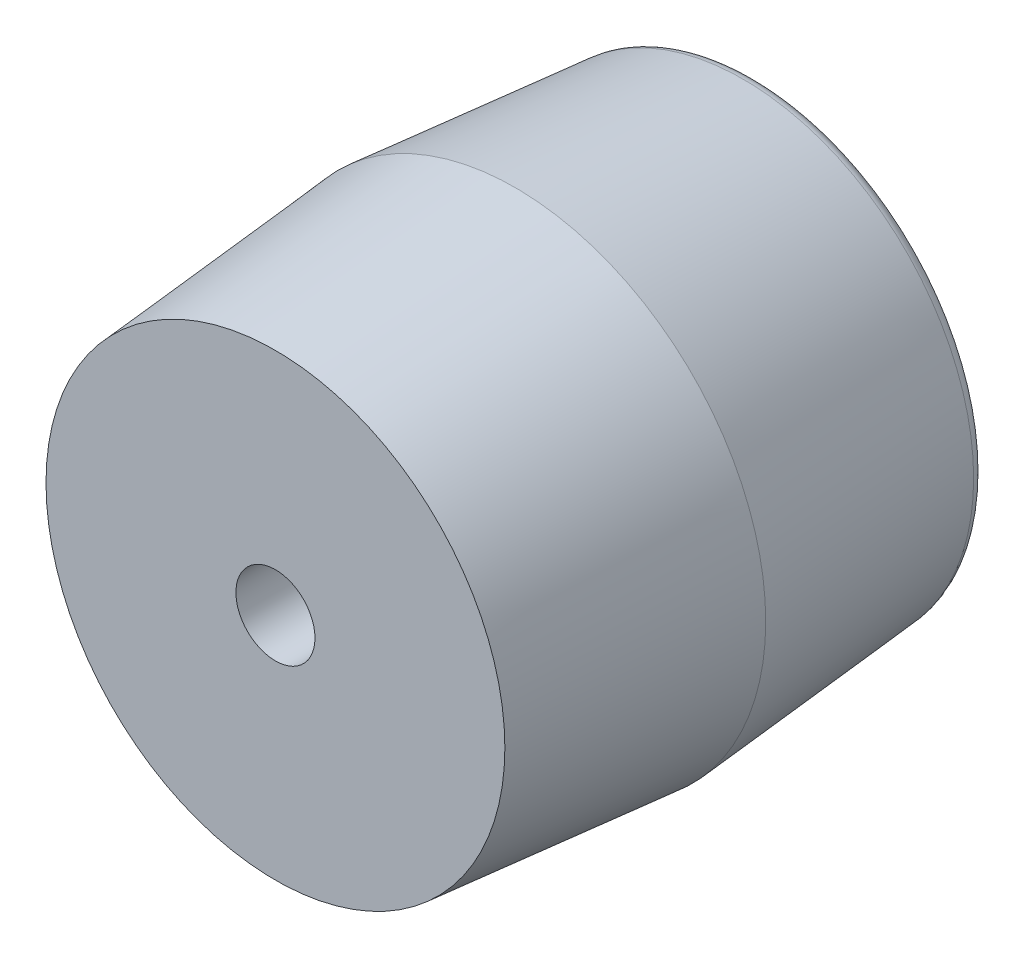
ISO-10303-21;
HEADER;
FILE_DESCRIPTION(('STEP AP214'),'2;1');
FILE_NAME('part.step','',(''),(''),'','','');
FILE_SCHEMA(('AUTOMOTIVE_DESIGN { 1 0 10303 214 1 1 1 1 }'));
ENDSEC;
DATA;
#1=APPLICATION_CONTEXT('core data for automotive mechanical design processes');
#2=APPLICATION_PROTOCOL_DEFINITION('international standard','automotive_design',2000,#1);
#3=PRODUCT_CONTEXT('',#1,'mechanical');
#4=PRODUCT('Part','Part','',(#3));
#5=PRODUCT_RELATED_PRODUCT_CATEGORY('part','',(#4));
#6=PRODUCT_DEFINITION_FORMATION('','',#4);
#7=PRODUCT_DEFINITION_CONTEXT('part definition',#1,'design');
#8=PRODUCT_DEFINITION('design','',#6,#7);
#9=PRODUCT_DEFINITION_SHAPE('','',#8);
#10=(LENGTH_UNIT() NAMED_UNIT(*) SI_UNIT(.MILLI.,.METRE.));
#11=(NAMED_UNIT(*) PLANE_ANGLE_UNIT() SI_UNIT($,.RADIAN.));
#12=(NAMED_UNIT(*) SI_UNIT($,.STERADIAN.) SOLID_ANGLE_UNIT());
#13=UNCERTAINTY_MEASURE_WITH_UNIT(LENGTH_MEASURE(1.E-05),#10,'distance_accuracy_value','');
#14=(GEOMETRIC_REPRESENTATION_CONTEXT(3) GLOBAL_UNCERTAINTY_ASSIGNED_CONTEXT((#13)) GLOBAL_UNIT_ASSIGNED_CONTEXT((#10,
#11,#12)) REPRESENTATION_CONTEXT('',''));
#15=CARTESIAN_POINT('',(0.,0.,0.));
#16=DIRECTION('',(0.,0.,1.));
#17=DIRECTION('',(1.,0.,0.));
#18=AXIS2_PLACEMENT_3D('',#15,#16,#17);
#19=CARTESIAN_POINT('',(0.,0.,-8.6));
#20=DIRECTION('',(0.,0.,1.));
#21=DIRECTION('',(1.,0.,0.));
#22=AXIS2_PLACEMENT_3D('',#19,#20,#21);
#23=TOROIDAL_SURFACE('',#22,8.24568757490538,0.5);
#24=CARTESIAN_POINT('',(0.,0.,-9.1));
#25=DIRECTION('',(0.,0.,1.));
#26=DIRECTION('',(1.,0.,0.));
#27=AXIS2_PLACEMENT_3D('',#24,#25,#26);
#28=CIRCLE('',#27,8.24568757490538);
#29=CARTESIAN_POINT('',(8.24568757490538,0.,-9.1));
#30=VERTEX_POINT('',#29);
#31=EDGE_CURVE('E37',#30,#30,#28,.F.);
#32=ORIENTED_EDGE('',*,*,#31,.F.);
#33=EDGE_LOOP('',(#32));
#34=FACE_BOUND('',#33,.T.);
#35=CARTESIAN_POINT('',(0.,0.,-8.64357787137383));
#36=DIRECTION('',(0.,0.,1.));
#37=DIRECTION('',(1.,0.,0.));
#38=AXIS2_PLACEMENT_3D('',#35,#36,#37);
#39=CIRCLE('',#38,8.74378492395125);
#40=CARTESIAN_POINT('',(8.74378492395125,0.,-8.64357787137383));
#41=VERTEX_POINT('',#40);
#42=EDGE_CURVE('E10',#41,#41,#39,.T.);
#43=ORIENTED_EDGE('',*,*,#42,.F.);
#44=EDGE_LOOP('',(#43));
#45=FACE_BOUND('',#44,.T.);
#46=ADVANCED_FACE('F31',(#34,#45),#23,.T.);
#47=CARTESIAN_POINT('',(0.,0.,0.));
#48=DIRECTION('',(0.,0.,1.));
#49=DIRECTION('',(1.,0.,0.));
#50=AXIS2_PLACEMENT_3D('',#47,#48,#49);
#51=CONICAL_SURFACE('',#50,9.5,0.0872664625997167);
#52=ORIENTED_EDGE('',*,*,#42,.T.);
#53=EDGE_LOOP('',(#52));
#54=FACE_BOUND('',#53,.T.);
#55=CARTESIAN_POINT('',(0.,0.,0.));
#56=DIRECTION('',(0.,0.,1.));
#57=DIRECTION('',(1.,0.,0.));
#58=AXIS2_PLACEMENT_3D('',#55,#56,#57);
#59=CIRCLE('',#58,9.5);
#60=CARTESIAN_POINT('',(9.5,0.,0.));
#61=VERTEX_POINT('',#60);
#62=EDGE_CURVE('E41',#61,#61,#59,.T.);
#63=ORIENTED_EDGE('',*,*,#62,.F.);
#64=EDGE_LOOP('',(#63));
#65=FACE_BOUND('',#64,.T.);
#66=ADVANCED_FACE('F73',(#54,#65),#51,.T.);
#67=CARTESIAN_POINT('',(0.,0.,-9.1));
#68=DIRECTION('',(0.,0.,1.));
#69=DIRECTION('',(1.,0.,0.));
#70=AXIS2_PLACEMENT_3D('',#67,#68,#69);
#71=PLANE('',#70);
#72=CARTESIAN_POINT('',(0.,0.,-9.1));
#73=DIRECTION('',(0.,0.,1.));
#74=DIRECTION('',(1.,0.,0.));
#75=AXIS2_PLACEMENT_3D('',#72,#73,#74);
#76=CIRCLE('',#75,1.5);
#77=CARTESIAN_POINT('',(1.5,0.,-9.1));
#78=VERTEX_POINT('',#77);
#79=EDGE_CURVE('E50',#78,#78,#76,.T.);
#80=ORIENTED_EDGE('',*,*,#79,.T.);
#81=EDGE_LOOP('',(#80));
#82=FACE_BOUND('',#81,.T.);
#83=ORIENTED_EDGE('',*,*,#31,.T.);
#84=EDGE_LOOP('',(#83));
#85=FACE_BOUND('',#84,.T.);
#86=ADVANCED_FACE('F69',(#82,#85),#71,.F.);
#87=CARTESIAN_POINT('',(0.,0.,0.));
#88=DIRECTION('',(0.,0.,-1.));
#89=DIRECTION('',(1.,0.,0.));
#90=AXIS2_PLACEMENT_3D('',#87,#88,#89);
#91=CONICAL_SURFACE('',#90,9.5,0.0872664625997167);
#92=CARTESIAN_POINT('',(0.,0.,9.1));
#93=DIRECTION('',(0.,0.,1.));
#94=DIRECTION('',(1.,0.,0.));
#95=AXIS2_PLACEMENT_3D('',#92,#93,#94);
#96=CIRCLE('',#95,8.70385316191409);
#97=CARTESIAN_POINT('',(8.70385316191409,0.,9.1));
#98=VERTEX_POINT('',#97);
#99=EDGE_CURVE('E45',#98,#98,#96,.T.);
#100=ORIENTED_EDGE('',*,*,#99,.F.);
#101=EDGE_LOOP('',(#100));
#102=FACE_BOUND('',#101,.T.);
#103=ORIENTED_EDGE('',*,*,#62,.T.);
#104=EDGE_LOOP('',(#103));
#105=FACE_BOUND('',#104,.T.);
#106=ADVANCED_FACE('F63',(#102,#105),#91,.T.);
#107=CARTESIAN_POINT('',(0.,0.,9.1));
#108=DIRECTION('',(0.,0.,1.));
#109=DIRECTION('',(1.,0.,0.));
#110=AXIS2_PLACEMENT_3D('',#107,#108,#109);
#111=PLANE('',#110);
#112=CARTESIAN_POINT('',(0.,0.,9.1));
#113=DIRECTION('',(0.,0.,1.));
#114=DIRECTION('',(1.,0.,0.));
#115=AXIS2_PLACEMENT_3D('',#112,#113,#114);
#116=CIRCLE('',#115,1.5);
#117=CARTESIAN_POINT('',(1.5,0.,9.1));
#118=VERTEX_POINT('',#117);
#119=EDGE_CURVE('E53',#118,#118,#116,.T.);
#120=ORIENTED_EDGE('',*,*,#119,.F.);
#121=EDGE_LOOP('',(#120));
#122=FACE_BOUND('',#121,.T.);
#123=ORIENTED_EDGE('',*,*,#99,.T.);
#124=EDGE_LOOP('',(#123));
#125=FACE_BOUND('',#124,.T.);
#126=ADVANCED_FACE('F60',(#122,#125),#111,.T.);
#127=CARTESIAN_POINT('',(0.,0.,-9.4));
#128=DIRECTION('',(0.,0.,1.));
#129=DIRECTION('',(1.,0.,0.));
#130=AXIS2_PLACEMENT_3D('',#127,#128,#129);
#131=CYLINDRICAL_SURFACE('',#130,1.5);
#132=ORIENTED_EDGE('',*,*,#119,.T.);
#133=EDGE_LOOP('',(#132));
#134=FACE_BOUND('',#133,.T.);
#135=ORIENTED_EDGE('',*,*,#79,.F.);
#136=EDGE_LOOP('',(#135));
#137=FACE_BOUND('',#136,.T.);
#138=ADVANCED_FACE('F57',(#134,#137),#131,.F.);
#139=CLOSED_SHELL('',(#46,#66,#86,#106,#126,#138));
#140=MANIFOLD_SOLID_BREP('B2',#139);
#141=ADVANCED_BREP_SHAPE_REPRESENTATION('',(#18,#140),#14);
#142=SHAPE_DEFINITION_REPRESENTATION(#9,#141);
ENDSEC;
END-ISO-10303-21;
